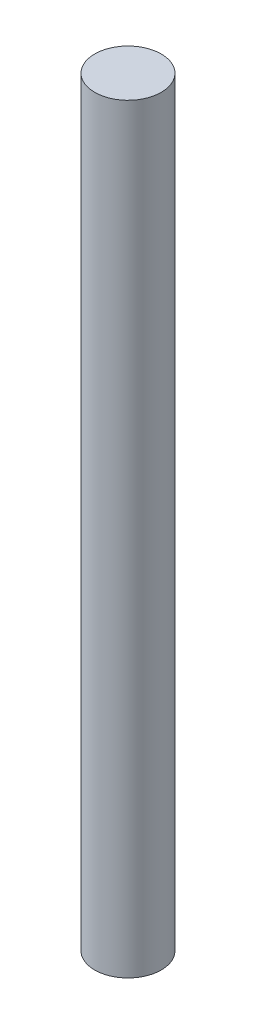
ISO-10303-21;
HEADER;
FILE_DESCRIPTION(('STEP AP214'),'2;1');
FILE_NAME('part.step','',(''),(''),'','','');
FILE_SCHEMA(('AUTOMOTIVE_DESIGN { 1 0 10303 214 1 1 1 1 }'));
ENDSEC;
DATA;
#1=APPLICATION_CONTEXT('core data for automotive mechanical design processes');
#2=APPLICATION_PROTOCOL_DEFINITION('international standard','automotive_design',2000,#1);
#3=PRODUCT_CONTEXT('',#1,'mechanical');
#4=PRODUCT('Part','Part','',(#3));
#5=PRODUCT_RELATED_PRODUCT_CATEGORY('part','',(#4));
#6=PRODUCT_DEFINITION_FORMATION('','',#4);
#7=PRODUCT_DEFINITION_CONTEXT('part definition',#1,'design');
#8=PRODUCT_DEFINITION('design','',#6,#7);
#9=PRODUCT_DEFINITION_SHAPE('','',#8);
#10=(LENGTH_UNIT() NAMED_UNIT(*) SI_UNIT(.MILLI.,.METRE.));
#11=(NAMED_UNIT(*) PLANE_ANGLE_UNIT() SI_UNIT($,.RADIAN.));
#12=(NAMED_UNIT(*) SI_UNIT($,.STERADIAN.) SOLID_ANGLE_UNIT());
#13=UNCERTAINTY_MEASURE_WITH_UNIT(LENGTH_MEASURE(1.E-05),#10,'distance_accuracy_value','');
#14=(GEOMETRIC_REPRESENTATION_CONTEXT(3) GLOBAL_UNCERTAINTY_ASSIGNED_CONTEXT((#13)) GLOBAL_UNIT_ASSIGNED_CONTEXT((#10,
#11,#12)) REPRESENTATION_CONTEXT('',''));
#15=CARTESIAN_POINT('',(0.,0.,0.));
#16=DIRECTION('',(0.,0.,1.));
#17=DIRECTION('',(1.,0.,0.));
#18=AXIS2_PLACEMENT_3D('',#15,#16,#17);
#19=CARTESIAN_POINT('',(-1.46202531645569,80.,-1.52848101265823));
#20=DIRECTION('',(0.,-1.,0.));
#21=DIRECTION('',(0.,0.,-1.));
#22=AXIS2_PLACEMENT_3D('',#19,#20,#21);
#23=CYLINDRICAL_SURFACE('',#22,3.5);
#24=CARTESIAN_POINT('',(-1.46202531645569,80.,-1.52848101265823));
#25=DIRECTION('',(0.,1.,0.));
#26=DIRECTION('',(0.,0.,1.));
#27=AXIS2_PLACEMENT_3D('',#24,#25,#26);
#28=CIRCLE('',#27,3.5);
#29=CARTESIAN_POINT('',(-1.46202531645569,80.,1.97151898734177));
#30=VERTEX_POINT('',#29);
#31=EDGE_CURVE('E10',#30,#30,#28,.T.);
#32=ORIENTED_EDGE('',*,*,#31,.F.);
#33=EDGE_LOOP('',(#32));
#34=FACE_BOUND('',#33,.T.);
#35=CARTESIAN_POINT('',(-1.46202531645569,0.,-1.52848101265823));
#36=DIRECTION('',(0.,1.,0.));
#37=DIRECTION('',(0.,0.,1.));
#38=AXIS2_PLACEMENT_3D('',#35,#36,#37);
#39=CIRCLE('',#38,3.5);
#40=CARTESIAN_POINT('',(-1.46202531645569,0.,1.97151898734177));
#41=VERTEX_POINT('',#40);
#42=EDGE_CURVE('E46',#41,#41,#39,.T.);
#43=ORIENTED_EDGE('',*,*,#42,.T.);
#44=EDGE_LOOP('',(#43));
#45=FACE_BOUND('',#44,.T.);
#46=ADVANCED_FACE('F43',(#34,#45),#23,.T.);
#47=CARTESIAN_POINT('',(-1.46202531645569,80.,-1.52848101265823));
#48=DIRECTION('',(0.,1.,0.));
#49=DIRECTION('',(0.,0.,1.));
#50=AXIS2_PLACEMENT_3D('',#47,#48,#49);
#51=PLANE('',#50);
#52=ORIENTED_EDGE('',*,*,#31,.T.);
#53=EDGE_LOOP('',(#52));
#54=FACE_BOUND('',#53,.T.);
#55=ADVANCED_FACE('F60',(#54),#51,.T.);
#56=CARTESIAN_POINT('',(-1.46202531645569,0.,-1.52848101265823));
#57=DIRECTION('',(0.,1.,0.));
#58=DIRECTION('',(0.,0.,1.));
#59=AXIS2_PLACEMENT_3D('',#56,#57,#58);
#60=PLANE('',#59);
#61=ORIENTED_EDGE('',*,*,#42,.F.);
#62=EDGE_LOOP('',(#61));
#63=FACE_BOUND('',#62,.T.);
#64=ADVANCED_FACE('F58',(#63),#60,.F.);
#65=CLOSED_SHELL('',(#46,#55,#64));
#66=MANIFOLD_SOLID_BREP('B2',#65);
#67=ADVANCED_BREP_SHAPE_REPRESENTATION('',(#18,#66),#14);
#68=SHAPE_DEFINITION_REPRESENTATION(#9,#67);
ENDSEC;
END-ISO-10303-21;
